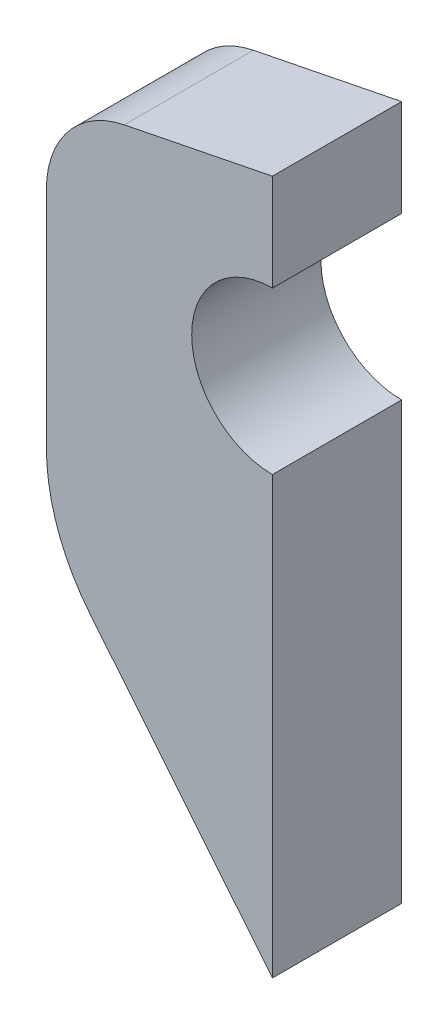
ISO-10303-21;
HEADER;
FILE_DESCRIPTION(('STEP AP214'),'2;1');
FILE_NAME('part.step','',(''),(''),'','','');
FILE_SCHEMA(('AUTOMOTIVE_DESIGN { 1 0 10303 214 1 1 1 1 }'));
ENDSEC;
DATA;
#1=APPLICATION_CONTEXT('core data for automotive mechanical design processes');
#2=APPLICATION_PROTOCOL_DEFINITION('international standard','automotive_design',2000,#1);
#3=PRODUCT_CONTEXT('',#1,'mechanical');
#4=PRODUCT('Part','Part','',(#3));
#5=PRODUCT_RELATED_PRODUCT_CATEGORY('part','',(#4));
#6=PRODUCT_DEFINITION_FORMATION('','',#4);
#7=PRODUCT_DEFINITION_CONTEXT('part definition',#1,'design');
#8=PRODUCT_DEFINITION('design','',#6,#7);
#9=PRODUCT_DEFINITION_SHAPE('','',#8);
#10=(LENGTH_UNIT() NAMED_UNIT(*) SI_UNIT(.MILLI.,.METRE.));
#11=(NAMED_UNIT(*) PLANE_ANGLE_UNIT() SI_UNIT($,.RADIAN.));
#12=(NAMED_UNIT(*) SI_UNIT($,.STERADIAN.) SOLID_ANGLE_UNIT());
#13=UNCERTAINTY_MEASURE_WITH_UNIT(LENGTH_MEASURE(1.E-05),#10,'distance_accuracy_value','');
#14=(GEOMETRIC_REPRESENTATION_CONTEXT(3) GLOBAL_UNCERTAINTY_ASSIGNED_CONTEXT((#13)) GLOBAL_UNIT_ASSIGNED_CONTEXT((#10,
#11,#12)) REPRESENTATION_CONTEXT('',''));
#15=CARTESIAN_POINT('',(0.,0.,0.));
#16=DIRECTION('',(0.,0.,1.));
#17=DIRECTION('',(1.,0.,0.));
#18=AXIS2_PLACEMENT_3D('',#15,#16,#17);
#19=CARTESIAN_POINT('',(0.,0.,4.));
#20=DIRECTION('',(0.,0.,-1.));
#21=DIRECTION('',(-1.,0.,0.));
#22=AXIS2_PLACEMENT_3D('',#19,#20,#21);
#23=CYLINDRICAL_SURFACE('',#22,2.5);
#24=CARTESIAN_POINT('',(0.,0.,0.));
#25=DIRECTION('',(0.,0.,1.));
#26=DIRECTION('',(1.,0.,0.));
#27=AXIS2_PLACEMENT_3D('',#24,#25,#26);
#28=CIRCLE('',#27,2.5);
#29=CARTESIAN_POINT('',(0.,2.5,0.));
#30=VERTEX_POINT('',#29);
#31=CARTESIAN_POINT('',(0.,-2.5,0.));
#32=VERTEX_POINT('',#31);
#33=EDGE_CURVE('E110',#30,#32,#28,.T.);
#34=ORIENTED_EDGE('',*,*,#33,.F.);
#35=DIRECTION('',(0.,0.,-1.));
#36=VECTOR('',#35,1.);
#37=CARTESIAN_POINT('',(0.,2.5,4.));
#38=LINE('',#37,#36);
#39=CARTESIAN_POINT('',(0.,2.5,4.));
#40=VERTEX_POINT('',#39);
#41=EDGE_CURVE('E105',#40,#30,#38,.T.);
#42=ORIENTED_EDGE('',*,*,#41,.F.);
#43=CARTESIAN_POINT('',(0.,0.,4.));
#44=DIRECTION('',(0.,0.,1.));
#45=DIRECTION('',(1.,0.,0.));
#46=AXIS2_PLACEMENT_3D('',#43,#44,#45);
#47=CIRCLE('',#46,2.5);
#48=CARTESIAN_POINT('',(0.,-2.5,4.));
#49=VERTEX_POINT('',#48);
#50=EDGE_CURVE('E108',#40,#49,#47,.T.);
#51=ORIENTED_EDGE('',*,*,#50,.T.);
#52=DIRECTION('',(0.,0.,-1.));
#53=VECTOR('',#52,1.);
#54=CARTESIAN_POINT('',(0.,-2.5,4.));
#55=LINE('',#54,#53);
#56=EDGE_CURVE('E151',#49,#32,#55,.T.);
#57=ORIENTED_EDGE('',*,*,#56,.T.);
#58=EDGE_LOOP('',(#34,#42,#51,#57));
#59=FACE_BOUND('',#58,.T.);
#60=ADVANCED_FACE('F41',(#59),#23,.F.);
#61=CARTESIAN_POINT('',(0.,0.,4.));
#62=DIRECTION('',(-1.,0.,0.));
#63=DIRECTION('',(0.,0.,1.));
#64=AXIS2_PLACEMENT_3D('',#61,#62,#63);
#65=PLANE('',#64);
#66=DIRECTION('',(0.,1.,0.));
#67=VECTOR('',#66,1.);
#68=CARTESIAN_POINT('',(0.,0.,0.));
#69=LINE('',#68,#67);
#70=CARTESIAN_POINT('',(0.,5.5,0.));
#71=VERTEX_POINT('',#70);
#72=EDGE_CURVE('E154',#30,#71,#69,.T.);
#73=ORIENTED_EDGE('',*,*,#72,.T.);
#74=DIRECTION('',(0.,0.,-1.));
#75=VECTOR('',#74,1.);
#76=CARTESIAN_POINT('',(0.,5.5,4.));
#77=LINE('',#76,#75);
#78=CARTESIAN_POINT('',(0.,5.5,4.));
#79=VERTEX_POINT('',#78);
#80=EDGE_CURVE('E115',#79,#71,#77,.T.);
#81=ORIENTED_EDGE('',*,*,#80,.F.);
#82=DIRECTION('',(0.,1.,0.));
#83=VECTOR('',#82,1.);
#84=CARTESIAN_POINT('',(0.,0.,4.));
#85=LINE('',#84,#83);
#86=EDGE_CURVE('E118',#40,#79,#85,.T.);
#87=ORIENTED_EDGE('',*,*,#86,.F.);
#88=ORIENTED_EDGE('',*,*,#41,.T.);
#89=EDGE_LOOP('',(#73,#81,#87,#88));
#90=FACE_BOUND('',#89,.T.);
#91=ADVANCED_FACE('F119',(#90),#65,.F.);
#92=CARTESIAN_POINT('',(-1.05769230769231,5.28846153846154,4.));
#93=DIRECTION('',(0.196116135138184,-0.98058067569092,0.));
#94=DIRECTION('',(0.98058067569092,0.196116135138184,0.));
#95=AXIS2_PLACEMENT_3D('',#92,#93,#94);
#96=PLANE('',#95);
#97=DIRECTION('',(-0.98058067569092,-0.196116135138184,0.));
#98=VECTOR('',#97,1.);
#99=CARTESIAN_POINT('',(-1.05769230769231,5.28846153846154,0.));
#100=LINE('',#99,#98);
#101=CARTESIAN_POINT('',(-4.58834840541455,4.58233031891709,0.));
#102=VERTEX_POINT('',#101);
#103=EDGE_CURVE('E157',#71,#102,#100,.T.);
#104=ORIENTED_EDGE('',*,*,#103,.T.);
#105=DIRECTION('',(0.,0.,-1.));
#106=VECTOR('',#105,1.);
#107=CARTESIAN_POINT('',(-4.58834840541455,4.58233031891709,4.));
#108=LINE('',#107,#106);
#109=CARTESIAN_POINT('',(-4.58834840541455,4.58233031891709,4.));
#110=VERTEX_POINT('',#109);
#111=EDGE_CURVE('E179',#102,#110,#108,.F.);
#112=ORIENTED_EDGE('',*,*,#111,.T.);
#113=DIRECTION('',(-0.98058067569092,-0.196116135138184,0.));
#114=VECTOR('',#113,1.);
#115=CARTESIAN_POINT('',(-1.05769230769231,5.28846153846154,4.));
#116=LINE('',#115,#114);
#117=EDGE_CURVE('E125',#79,#110,#116,.T.);
#118=ORIENTED_EDGE('',*,*,#117,.F.);
#119=ORIENTED_EDGE('',*,*,#80,.T.);
#120=EDGE_LOOP('',(#104,#112,#118,#119));
#121=FACE_BOUND('',#120,.T.);
#122=ADVANCED_FACE('F213',(#121),#96,.F.);
#123=CARTESIAN_POINT('',(-7.,0.,4.));
#124=DIRECTION('',(-1.,0.,0.));
#125=DIRECTION('',(0.,0.,1.));
#126=AXIS2_PLACEMENT_3D('',#123,#124,#125);
#127=PLANE('',#126);
#128=DIRECTION('',(0.,1.,0.));
#129=VECTOR('',#128,1.);
#130=CARTESIAN_POINT('',(-7.,0.,0.));
#131=LINE('',#130,#129);
#132=CARTESIAN_POINT('',(-7.,-5.26680026814004,0.));
#133=VERTEX_POINT('',#132);
#134=CARTESIAN_POINT('',(-7.,1.64058829184433,0.));
#135=VERTEX_POINT('',#134);
#136=EDGE_CURVE('E161',#133,#135,#131,.T.);
#137=ORIENTED_EDGE('',*,*,#136,.F.);
#138=DIRECTION('',(0.,0.,-1.));
#139=VECTOR('',#138,1.);
#140=CARTESIAN_POINT('',(-7.,-5.26680026814004,4.));
#141=LINE('',#140,#139);
#142=CARTESIAN_POINT('',(-7.,-5.26680026814004,4.));
#143=VERTEX_POINT('',#142);
#144=EDGE_CURVE('E50',#133,#143,#141,.F.);
#145=ORIENTED_EDGE('',*,*,#144,.T.);
#146=DIRECTION('',(0.,1.,0.));
#147=VECTOR('',#146,1.);
#148=CARTESIAN_POINT('',(-7.,0.,4.));
#149=LINE('',#148,#147);
#150=CARTESIAN_POINT('',(-7.,1.64058829184433,4.));
#151=VERTEX_POINT('',#150);
#152=EDGE_CURVE('E142',#143,#151,#149,.T.);
#153=ORIENTED_EDGE('',*,*,#152,.T.);
#154=DIRECTION('',(0.,0.,-1.));
#155=VECTOR('',#154,1.);
#156=CARTESIAN_POINT('',(-7.,1.64058829184433,0.));
#157=LINE('',#156,#155);
#158=EDGE_CURVE('E114',#151,#135,#157,.T.);
#159=ORIENTED_EDGE('',*,*,#158,.T.);
#160=EDGE_LOOP('',(#137,#145,#153,#159));
#161=FACE_BOUND('',#160,.T.);
#162=ADVANCED_FACE('F218',(#161),#127,.T.);
#163=CARTESIAN_POINT('',(-7.8334417696812,-6.37605725439167,4.));
#164=DIRECTION('',(-0.775562003711193,-0.631271398369576,0.));
#165=DIRECTION('',(0.631271398369576,-0.775562003711193,0.));
#166=AXIS2_PLACEMENT_3D('',#163,#164,#165);
#167=PLANE('',#166);
#168=DIRECTION('',(-0.631271398369576,0.775562003711193,0.));
#169=VECTOR('',#168,1.);
#170=CARTESIAN_POINT('',(-7.8334417696812,-6.37605725439167,4.));
#171=LINE('',#170,#169);
#172=CARTESIAN_POINT('',(0.,-16.,4.));
#173=VERTEX_POINT('',#172);
#174=CARTESIAN_POINT('',(-5.65337202226716,-9.05442865835749,4.));
#175=VERTEX_POINT('',#174);
#176=EDGE_CURVE('E145',#173,#175,#171,.T.);
#177=ORIENTED_EDGE('',*,*,#176,.T.);
#178=DIRECTION('',(0.,0.,-1.));
#179=VECTOR('',#178,1.);
#180=CARTESIAN_POINT('',(-5.65337202226716,-9.05442865835749,4.));
#181=LINE('',#180,#179);
#182=CARTESIAN_POINT('',(-5.65337202226716,-9.05442865835749,0.));
#183=VERTEX_POINT('',#182);
#184=EDGE_CURVE('E186',#175,#183,#181,.T.);
#185=ORIENTED_EDGE('',*,*,#184,.T.);
#186=DIRECTION('',(-0.631271398369576,0.775562003711193,0.));
#187=VECTOR('',#186,1.);
#188=CARTESIAN_POINT('',(-7.8334417696812,-6.37605725439167,0.));
#189=LINE('',#188,#187);
#190=CARTESIAN_POINT('',(0.,-16.,0.));
#191=VERTEX_POINT('',#190);
#192=EDGE_CURVE('E137',#191,#183,#189,.T.);
#193=ORIENTED_EDGE('',*,*,#192,.F.);
#194=DIRECTION('',(0.,0.,-1.));
#195=VECTOR('',#194,1.);
#196=CARTESIAN_POINT('',(0.,-16.,4.));
#197=LINE('',#196,#195);
#198=EDGE_CURVE('E168',#173,#191,#197,.T.);
#199=ORIENTED_EDGE('',*,*,#198,.F.);
#200=EDGE_LOOP('',(#177,#185,#193,#199));
#201=FACE_BOUND('',#200,.T.);
#202=ADVANCED_FACE('F195',(#201),#167,.T.);
#203=CARTESIAN_POINT('',(0.,0.,4.));
#204=DIRECTION('',(-1.,0.,0.));
#205=DIRECTION('',(0.,0.,1.));
#206=AXIS2_PLACEMENT_3D('',#203,#204,#205);
#207=PLANE('',#206);
#208=DIRECTION('',(0.,1.,0.));
#209=VECTOR('',#208,1.);
#210=CARTESIAN_POINT('',(0.,0.,0.));
#211=LINE('',#210,#209);
#212=EDGE_CURVE('E133',#191,#32,#211,.T.);
#213=ORIENTED_EDGE('',*,*,#212,.T.);
#214=ORIENTED_EDGE('',*,*,#56,.F.);
#215=DIRECTION('',(0.,1.,0.));
#216=VECTOR('',#215,1.);
#217=CARTESIAN_POINT('',(0.,0.,4.));
#218=LINE('',#217,#216);
#219=EDGE_CURVE('E130',#173,#49,#218,.T.);
#220=ORIENTED_EDGE('',*,*,#219,.F.);
#221=ORIENTED_EDGE('',*,*,#198,.T.);
#222=EDGE_LOOP('',(#213,#214,#220,#221));
#223=FACE_BOUND('',#222,.T.);
#224=ADVANCED_FACE('F201',(#223),#207,.F.);
#225=CARTESIAN_POINT('',(0.,0.,4.));
#226=DIRECTION('',(0.,0.,1.));
#227=DIRECTION('',(1.,0.,0.));
#228=AXIS2_PLACEMENT_3D('',#225,#226,#227);
#229=PLANE('',#228);
#230=ORIENTED_EDGE('',*,*,#152,.F.);
#231=CARTESIAN_POINT('',(-1.,-5.26680026814004,4.));
#232=DIRECTION('',(0.,0.,1.));
#233=DIRECTION('',(1.,0.,0.));
#234=AXIS2_PLACEMENT_3D('',#231,#232,#233);
#235=CIRCLE('',#234,6.);
#236=EDGE_CURVE('E11',#143,#175,#235,.T.);
#237=ORIENTED_EDGE('',*,*,#236,.T.);
#238=ORIENTED_EDGE('',*,*,#176,.F.);
#239=ORIENTED_EDGE('',*,*,#219,.T.);
#240=ORIENTED_EDGE('',*,*,#50,.F.);
#241=ORIENTED_EDGE('',*,*,#86,.T.);
#242=ORIENTED_EDGE('',*,*,#117,.T.);
#243=CARTESIAN_POINT('',(-4.,1.64058829184433,4.));
#244=DIRECTION('',(0.,0.,1.));
#245=DIRECTION('',(1.,0.,0.));
#246=AXIS2_PLACEMENT_3D('',#243,#244,#245);
#247=CIRCLE('',#246,3.);
#248=EDGE_CURVE('E182',#110,#151,#247,.T.);
#249=ORIENTED_EDGE('',*,*,#248,.T.);
#250=EDGE_LOOP('',(#230,#237,#238,#239,#240,#241,#242,#249));
#251=FACE_BOUND('',#250,.T.);
#252=ADVANCED_FACE('F127',(#251),#229,.T.);
#253=CARTESIAN_POINT('',(0.,0.,0.));
#254=DIRECTION('',(0.,0.,1.));
#255=DIRECTION('',(1.,0.,0.));
#256=AXIS2_PLACEMENT_3D('',#253,#254,#255);
#257=PLANE('',#256);
#258=ORIENTED_EDGE('',*,*,#192,.T.);
#259=CARTESIAN_POINT('',(-1.,-5.26680026814004,0.));
#260=DIRECTION('',(0.,0.,1.));
#261=DIRECTION('',(1.,0.,0.));
#262=AXIS2_PLACEMENT_3D('',#259,#260,#261);
#263=CIRCLE('',#262,6.);
#264=EDGE_CURVE('E64',#183,#133,#263,.F.);
#265=ORIENTED_EDGE('',*,*,#264,.T.);
#266=ORIENTED_EDGE('',*,*,#136,.T.);
#267=CARTESIAN_POINT('',(-4.,1.64058829184433,0.));
#268=DIRECTION('',(0.,0.,1.));
#269=DIRECTION('',(1.,0.,0.));
#270=AXIS2_PLACEMENT_3D('',#267,#268,#269);
#271=CIRCLE('',#270,3.);
#272=EDGE_CURVE('E176',#135,#102,#271,.F.);
#273=ORIENTED_EDGE('',*,*,#272,.T.);
#274=ORIENTED_EDGE('',*,*,#103,.F.);
#275=ORIENTED_EDGE('',*,*,#72,.F.);
#276=ORIENTED_EDGE('',*,*,#33,.T.);
#277=ORIENTED_EDGE('',*,*,#212,.F.);
#278=EDGE_LOOP('',(#258,#265,#266,#273,#274,#275,#276,#277));
#279=FACE_BOUND('',#278,.T.);
#280=ADVANCED_FACE('F199',(#279),#257,.F.);
#281=CARTESIAN_POINT('',(-4.,1.64058829184433,4.));
#282=DIRECTION('',(0.,0.,1.));
#283=DIRECTION('',(1.,0.,0.));
#284=AXIS2_PLACEMENT_3D('',#281,#282,#283);
#285=CYLINDRICAL_SURFACE('',#284,3.);
#286=ORIENTED_EDGE('',*,*,#248,.F.);
#287=ORIENTED_EDGE('',*,*,#111,.F.);
#288=ORIENTED_EDGE('',*,*,#272,.F.);
#289=ORIENTED_EDGE('',*,*,#158,.F.);
#290=EDGE_LOOP('',(#286,#287,#288,#289));
#291=FACE_BOUND('',#290,.T.);
#292=ADVANCED_FACE('F203',(#291),#285,.T.);
#293=CARTESIAN_POINT('',(-1.,-5.26680026814004,4.));
#294=DIRECTION('',(0.,0.,-1.));
#295=DIRECTION('',(-1.,0.,0.));
#296=AXIS2_PLACEMENT_3D('',#293,#294,#295);
#297=CYLINDRICAL_SURFACE('',#296,6.);
#298=ORIENTED_EDGE('',*,*,#236,.F.);
#299=ORIENTED_EDGE('',*,*,#144,.F.);
#300=ORIENTED_EDGE('',*,*,#264,.F.);
#301=ORIENTED_EDGE('',*,*,#184,.F.);
#302=EDGE_LOOP('',(#298,#299,#300,#301));
#303=FACE_BOUND('',#302,.T.);
#304=ADVANCED_FACE('F43',(#303),#297,.T.);
#305=CLOSED_SHELL('',(#60,#91,#122,#162,#202,#224,#252,#280,#292,#304));
#306=MANIFOLD_SOLID_BREP('B2',#305);
#307=ADVANCED_BREP_SHAPE_REPRESENTATION('',(#18,#306),#14);
#308=SHAPE_DEFINITION_REPRESENTATION(#9,#307);
ENDSEC;
END-ISO-10303-21;
